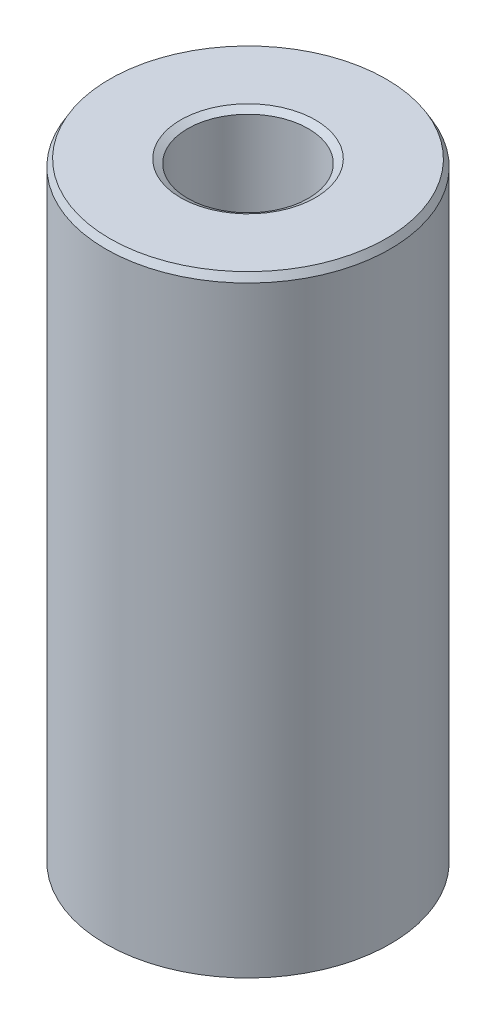
ISO-10303-21;
HEADER;
FILE_DESCRIPTION(('STEP AP214'),'2;1');
FILE_NAME('part.step','',(''),(''),'','','');
FILE_SCHEMA(('AUTOMOTIVE_DESIGN { 1 0 10303 214 1 1 1 1 }'));
ENDSEC;
DATA;
#1=APPLICATION_CONTEXT('core data for automotive mechanical design processes');
#2=APPLICATION_PROTOCOL_DEFINITION('international standard','automotive_design',2000,#1);
#3=PRODUCT_CONTEXT('',#1,'mechanical');
#4=PRODUCT('Part','Part','',(#3));
#5=PRODUCT_RELATED_PRODUCT_CATEGORY('part','',(#4));
#6=PRODUCT_DEFINITION_FORMATION('','',#4);
#7=PRODUCT_DEFINITION_CONTEXT('part definition',#1,'design');
#8=PRODUCT_DEFINITION('design','',#6,#7);
#9=PRODUCT_DEFINITION_SHAPE('','',#8);
#10=(LENGTH_UNIT() NAMED_UNIT(*) SI_UNIT(.MILLI.,.METRE.));
#11=(NAMED_UNIT(*) PLANE_ANGLE_UNIT() SI_UNIT($,.RADIAN.));
#12=(NAMED_UNIT(*) SI_UNIT($,.STERADIAN.) SOLID_ANGLE_UNIT());
#13=UNCERTAINTY_MEASURE_WITH_UNIT(LENGTH_MEASURE(1.E-05),#10,'distance_accuracy_value','');
#14=(GEOMETRIC_REPRESENTATION_CONTEXT(3) GLOBAL_UNCERTAINTY_ASSIGNED_CONTEXT((#13)) GLOBAL_UNIT_ASSIGNED_CONTEXT((#10,
#11,#12)) REPRESENTATION_CONTEXT('',''));
#15=CARTESIAN_POINT('',(0.,0.,0.));
#16=DIRECTION('',(0.,0.,1.));
#17=DIRECTION('',(1.,0.,0.));
#18=AXIS2_PLACEMENT_3D('',#15,#16,#17);
#19=CARTESIAN_POINT('',(0.,183.114524701273,0.));
#20=DIRECTION('',(0.,-1.,0.));
#21=DIRECTION('',(0.,0.,-1.));
#22=AXIS2_PLACEMENT_3D('',#19,#20,#21);
#23=CYLINDRICAL_SURFACE('',#22,42.5);
#24=CARTESIAN_POINT('',(0.,1.21213991563171,0.));
#25=DIRECTION('',(0.,1.,0.));
#26=DIRECTION('',(0.,0.,1.));
#27=AXIS2_PLACEMENT_3D('',#24,#25,#26);
#28=CIRCLE('',#27,42.5);
#29=CARTESIAN_POINT('',(0.,1.21213991563168,-42.5));
#30=VERTEX_POINT('',#29);
#31=EDGE_CURVE('E10',#30,#30,#28,.T.);
#32=CARTESIAN_POINT('',(0.,181.015036781517,0.));
#33=DIRECTION('',(0.,1.,0.));
#34=DIRECTION('',(0.,0.,1.));
#35=AXIS2_PLACEMENT_3D('',#32,#33,#34);
#36=CIRCLE('',#35,42.5);
#37=CARTESIAN_POINT('',(0.,181.015036781517,-42.5));
#38=VERTEX_POINT('',#37);
#39=EDGE_CURVE('E50',#38,#38,#36,.F.);
#40=CARTESIAN_POINT('',(0.,1.21213991563168,-42.5));
#41=CARTESIAN_POINT('',(0.,3.08508675798466,-42.5));
#42=CARTESIAN_POINT('',(0.,4.95803360033764,-42.5));
#43=CARTESIAN_POINT('',(0.,8.70392728504359,-42.5));
#44=CARTESIAN_POINT('',(0.,10.5768741273966,-42.5));
#45=CARTESIAN_POINT('',(0.,14.3227678121025,-42.5));
#46=CARTESIAN_POINT('',(0.,16.1957146544555,-42.5));
#47=CARTESIAN_POINT('',(0.,19.9416083391614,-42.5));
#48=CARTESIAN_POINT('',(0.,21.8145551815144,-42.5));
#49=CARTESIAN_POINT('',(0.,25.5604488662204,-42.5));
#50=CARTESIAN_POINT('',(0.,27.4333957085734,-42.5));
#51=CARTESIAN_POINT('',(0.,31.1792893932793,-42.5));
#52=CARTESIAN_POINT('',(0.,33.0522362356323,-42.5));
#53=CARTESIAN_POINT('',(0.,36.7981299203382,-42.5));
#54=CARTESIAN_POINT('',(0.,38.6710767626912,-42.5));
#55=CARTESIAN_POINT('',(0.,42.4169704473972,-42.5));
#56=CARTESIAN_POINT('',(0.,44.2899172897502,-42.5));
#57=CARTESIAN_POINT('',(0.,48.0358109744561,-42.5));
#58=CARTESIAN_POINT('',(0.,49.9087578168091,-42.5));
#59=CARTESIAN_POINT('',(0.,53.654651501515,-42.5));
#60=CARTESIAN_POINT('',(0.,55.527598343868,-42.5));
#61=CARTESIAN_POINT('',(0.,59.273492028574,-42.5));
#62=CARTESIAN_POINT('',(0.,61.1464388709269,-42.5));
#63=CARTESIAN_POINT('',(0.,64.8923325556329,-42.5));
#64=CARTESIAN_POINT('',(0.,66.7652793979858,-42.5));
#65=CARTESIAN_POINT('',(0.,70.5111730826918,-42.5));
#66=CARTESIAN_POINT('',(0.,72.3841199250448,-42.5));
#67=CARTESIAN_POINT('',(0.,76.1300136097507,-42.5));
#68=CARTESIAN_POINT('',(0.,78.0029604521037,-42.5));
#69=CARTESIAN_POINT('',(0.,81.7488541368097,-42.5));
#70=CARTESIAN_POINT('',(0.,83.6218009791626,-42.5));
#71=CARTESIAN_POINT('',(0.,87.3676946638686,-42.5));
#72=CARTESIAN_POINT('',(0.,89.2406415062216,-42.5));
#73=CARTESIAN_POINT('',(0.,92.9865351909275,-42.5));
#74=CARTESIAN_POINT('',(0.,94.8594820332805,-42.5));
#75=CARTESIAN_POINT('',(0.,98.6053757179864,-42.5));
#76=CARTESIAN_POINT('',(0.,100.478322560339,-42.5));
#77=CARTESIAN_POINT('',(0.,104.224216245045,-42.5));
#78=CARTESIAN_POINT('',(0.,106.097163087398,-42.5));
#79=CARTESIAN_POINT('',(0.,109.843056772104,-42.5));
#80=CARTESIAN_POINT('',(0.,111.716003614457,-42.5));
#81=CARTESIAN_POINT('',(0.,115.461897299163,-42.5));
#82=CARTESIAN_POINT('',(0.,117.334844141516,-42.5));
#83=CARTESIAN_POINT('',(0.,121.080737826222,-42.5));
#84=CARTESIAN_POINT('',(0.,122.953684668575,-42.5));
#85=CARTESIAN_POINT('',(0.,126.699578353281,-42.5));
#86=CARTESIAN_POINT('',(0.,128.572525195634,-42.5));
#87=CARTESIAN_POINT('',(0.,132.31841888034,-42.5));
#88=CARTESIAN_POINT('',(0.,134.191365722693,-42.5));
#89=CARTESIAN_POINT('',(0.,137.937259407399,-42.5));
#90=CARTESIAN_POINT('',(0.,139.810206249752,-42.5));
#91=CARTESIAN_POINT('',(0.,143.556099934458,-42.5));
#92=CARTESIAN_POINT('',(0.,145.429046776811,-42.5));
#93=CARTESIAN_POINT('',(0.,149.174940461517,-42.5));
#94=CARTESIAN_POINT('',(0.,151.04788730387,-42.5));
#95=CARTESIAN_POINT('',(0.,154.793780988576,-42.5));
#96=CARTESIAN_POINT('',(0.,156.666727830929,-42.5));
#97=CARTESIAN_POINT('',(0.,160.412621515635,-42.5));
#98=CARTESIAN_POINT('',(0.,162.285568357988,-42.5));
#99=CARTESIAN_POINT('',(0.,166.031462042694,-42.5));
#100=CARTESIAN_POINT('',(0.,167.904408885047,-42.5));
#101=CARTESIAN_POINT('',(0.,171.650302569753,-42.5));
#102=CARTESIAN_POINT('',(0.,173.523249412105,-42.5));
#103=CARTESIAN_POINT('',(0.,177.269143096811,-42.5));
#104=CARTESIAN_POINT('',(0.,179.142089939164,-42.5));
#105=CARTESIAN_POINT('',(0.,181.015036781517,-42.5));
#106=B_SPLINE_CURVE_WITH_KNOTS('',3,(#40,#41,#42,#43,#44,#45,#46,#47,#48,#49,#50,#51,#52,#53,
#54,#55,#56,#57,#58,#59,#60,#61,#62,#63,#64,#65,#66,#67,#68,#69,#70,#71,#72,#73,#74,#75,#76,#77,
#78,#79,#80,#81,#82,#83,#84,#85,#86,#87,#88,#89,#90,#91,#92,#93,#94,#95,#96,#97,#98,#99,#100,
#101,#102,#103,#104,#105),.UNSPECIFIED.,.F.,.F.,(4,2,2,2,2,2,2,2,2,2,2,2,2,2,2,2,2,2,2,2,2,2,2,
2,2,2,2,2,2,2,2,2,4),(0.,5.61884052705894,11.2376810541178,16.8565215811768,22.4753621082357,
28.0942026352947,33.7130431623536,39.3318836894125,44.9507242164714,50.5695647435304,
56.1884052705893,61.8072457976482,67.4260863247071,73.0449268517661,78.663767378825,
84.2826079058839,89.9014484329429,95.5202889600018,101.139129487061,106.75797001412,
112.376810541179,117.995651068238,123.614491595296,129.233332122355,134.852172649414,
140.471013176473,146.089853703532,151.708694230591,157.32753475765,162.946375284709,
168.565215811768,174.184056338827,179.802896865886),.UNSPECIFIED.);
#107=EDGE_CURVE('BSEAM39',#30,#38,#106,.T.);
#108=ORIENTED_EDGE('',*,*,#31,.T.);
#109=ORIENTED_EDGE('',*,*,#39,.T.);
#110=ORIENTED_EDGE('',*,*,#107,.T.);
#111=ORIENTED_EDGE('',*,*,#107,.F.);
#112=EDGE_LOOP('',(#108,#110,#109,#111));
#113=FACE_BOUND('',#112,.T.);
#114=ADVANCED_FACE('F39',(#113),#23,.T.);
#115=CARTESIAN_POINT('',(0.,183.114524701273,0.));
#116=DIRECTION('',(0.,1.,0.));
#117=DIRECTION('',(0.,0.,1.));
#118=AXIS2_PLACEMENT_3D('',#115,#116,#117);
#119=PLANE('',#118);
#120=CARTESIAN_POINT('',(0.,183.114524701273,0.));
#121=DIRECTION('',(0.,1.,0.));
#122=DIRECTION('',(0.,0.,1.));
#123=AXIS2_PLACEMENT_3D('',#120,#121,#122);
#124=CIRCLE('',#123,20.1404680415257);
#125=CARTESIAN_POINT('',(0.,183.114524701273,20.1404680415257));
#126=VERTEX_POINT('',#125);
#127=EDGE_CURVE('E58',#126,#126,#124,.F.);
#128=ORIENTED_EDGE('',*,*,#127,.T.);
#129=EDGE_LOOP('',(#128));
#130=FACE_BOUND('',#129,.T.);
#131=CARTESIAN_POINT('',(0.,183.114524701273,0.));
#132=DIRECTION('',(0.,1.,0.));
#133=DIRECTION('',(0.,0.,1.));
#134=AXIS2_PLACEMENT_3D('',#131,#132,#133);
#135=CIRCLE('',#134,41.2878600843685);
#136=CARTESIAN_POINT('',(0.,183.114524701273,41.2878600843685));
#137=VERTEX_POINT('',#136);
#138=EDGE_CURVE('E61',#137,#137,#135,.T.);
#139=ORIENTED_EDGE('',*,*,#138,.T.);
#140=EDGE_LOOP('',(#139));
#141=FACE_BOUND('',#140,.T.);
#142=ADVANCED_FACE('F88',(#130,#141),#119,.T.);
#143=CARTESIAN_POINT('',(0.,0.,0.));
#144=DIRECTION('',(0.,1.,0.));
#145=DIRECTION('',(0.,0.,1.));
#146=AXIS2_PLACEMENT_3D('',#143,#144,#145);
#147=PLANE('',#146);
#148=CARTESIAN_POINT('',(0.,0.,0.));
#149=DIRECTION('',(0.,1.,0.));
#150=DIRECTION('',(0.,0.,1.));
#151=AXIS2_PLACEMENT_3D('',#148,#149,#150);
#152=CIRCLE('',#151,19.2531200374009);
#153=CARTESIAN_POINT('',(0.,0.,19.2531200374009));
#154=VERTEX_POINT('',#153);
#155=EDGE_CURVE('E51',#154,#154,#152,.T.);
#156=ORIENTED_EDGE('',*,*,#155,.T.);
#157=EDGE_LOOP('',(#156));
#158=FACE_BOUND('',#157,.T.);
#159=CARTESIAN_POINT('',(0.,0.,0.));
#160=DIRECTION('',(0.,1.,0.));
#161=DIRECTION('',(0.,0.,1.));
#162=AXIS2_PLACEMENT_3D('',#159,#160,#161);
#163=CIRCLE('',#162,40.4005120802436);
#164=CARTESIAN_POINT('',(0.,0.,40.4005120802436));
#165=VERTEX_POINT('',#164);
#166=EDGE_CURVE('E54',#165,#165,#163,.F.);
#167=ORIENTED_EDGE('',*,*,#166,.T.);
#168=EDGE_LOOP('',(#167));
#169=FACE_BOUND('',#168,.T.);
#170=ADVANCED_FACE('F83',(#158,#169),#147,.F.);
#171=CARTESIAN_POINT('',(0.,183.114524701273,0.));
#172=DIRECTION('',(0.,-1.,0.));
#173=DIRECTION('',(0.,0.,-1.));
#174=AXIS2_PLACEMENT_3D('',#171,#172,#173);
#175=CYLINDRICAL_SURFACE('',#174,18.0409801217693);
#176=CARTESIAN_POINT('',(0.,181.902384785642,0.));
#177=DIRECTION('',(0.,1.,0.));
#178=DIRECTION('',(0.,0.,1.));
#179=AXIS2_PLACEMENT_3D('',#176,#177,#178);
#180=CIRCLE('',#179,18.0409801217693);
#181=CARTESIAN_POINT('',(0.,181.902384785642,-18.0409801217693));
#182=VERTEX_POINT('',#181);
#183=EDGE_CURVE('E67',#182,#182,#180,.T.);
#184=CARTESIAN_POINT('',(0.,2.09948791975623,0.));
#185=DIRECTION('',(0.,1.,0.));
#186=DIRECTION('',(0.,0.,1.));
#187=AXIS2_PLACEMENT_3D('',#184,#185,#186);
#188=CIRCLE('',#187,18.0409801217693);
#189=CARTESIAN_POINT('',(0.,2.09948791975623,-18.0409801217693));
#190=VERTEX_POINT('',#189);
#191=EDGE_CURVE('E69',#190,#190,#188,.F.);
#192=CARTESIAN_POINT('',(0.,181.902384785642,-18.0409801217693));
#193=CARTESIAN_POINT('',(0.,180.029437943289,-18.0409801217693));
#194=CARTESIAN_POINT('',(0.,178.156491100936,-18.0409801217693));
#195=CARTESIAN_POINT('',(0.,174.41059741623,-18.0409801217693));
#196=CARTESIAN_POINT('',(0.,172.537650573877,-18.0409801217693));
#197=CARTESIAN_POINT('',(0.,168.791756889171,-18.0409801217693));
#198=CARTESIAN_POINT('',(0.,166.918810046818,-18.0409801217693));
#199=CARTESIAN_POINT('',(0.,163.172916362112,-18.0409801217693));
#200=CARTESIAN_POINT('',(0.,161.299969519759,-18.0409801217693));
#201=CARTESIAN_POINT('',(0.,157.554075835053,-18.0409801217693));
#202=CARTESIAN_POINT('',(0.,155.6811289927,-18.0409801217693));
#203=CARTESIAN_POINT('',(0.,151.935235307994,-18.0409801217693));
#204=CARTESIAN_POINT('',(0.,150.062288465641,-18.0409801217693));
#205=CARTESIAN_POINT('',(0.,146.316394780935,-18.0409801217693));
#206=CARTESIAN_POINT('',(0.,144.443447938582,-18.0409801217693));
#207=CARTESIAN_POINT('',(0.,140.697554253876,-18.0409801217693));
#208=CARTESIAN_POINT('',(0.,138.824607411523,-18.0409801217693));
#209=CARTESIAN_POINT('',(0.,135.078713726817,-18.0409801217693));
#210=CARTESIAN_POINT('',(0.,133.205766884464,-18.0409801217693));
#211=CARTESIAN_POINT('',(0.,129.459873199758,-18.0409801217693));
#212=CARTESIAN_POINT('',(0.,127.586926357405,-18.0409801217693));
#213=CARTESIAN_POINT('',(0.,123.8410326727,-18.0409801217693));
#214=CARTESIAN_POINT('',(0.,121.968085830347,-18.0409801217693));
#215=CARTESIAN_POINT('',(0.,118.222192145641,-18.0409801217693));
#216=CARTESIAN_POINT('',(0.,116.349245303288,-18.0409801217693));
#217=CARTESIAN_POINT('',(0.,112.603351618582,-18.0409801217693));
#218=CARTESIAN_POINT('',(0.,110.730404776229,-18.0409801217693));
#219=CARTESIAN_POINT('',(0.,106.984511091523,-18.0409801217693));
#220=CARTESIAN_POINT('',(0.,105.11156424917,-18.0409801217693));
#221=CARTESIAN_POINT('',(0.,101.365670564464,-18.0409801217693));
#222=CARTESIAN_POINT('',(0.,99.4927237221109,-18.0409801217693));
#223=CARTESIAN_POINT('',(0.,95.7468300374049,-18.0409801217693));
#224=CARTESIAN_POINT('',(0.,93.8738831950519,-18.0409801217693));
#225=CARTESIAN_POINT('',(0.,90.127989510346,-18.0409801217693));
#226=CARTESIAN_POINT('',(0.,88.255042667993,-18.0409801217693));
#227=CARTESIAN_POINT('',(0.,84.5091489832871,-18.0409801217693));
#228=CARTESIAN_POINT('',(0.,82.6362021409341,-18.0409801217693));
#229=CARTESIAN_POINT('',(0.,78.8903084562281,-18.0409801217693));
#230=CARTESIAN_POINT('',(0.,77.0173616138752,-18.0409801217693));
#231=CARTESIAN_POINT('',(0.,73.2714679291692,-18.0409801217693));
#232=CARTESIAN_POINT('',(0.,71.3985210868163,-18.0409801217693));
#233=CARTESIAN_POINT('',(0.,67.6526274021103,-18.0409801217693));
#234=CARTESIAN_POINT('',(0.,65.7796805597573,-18.0409801217693));
#235=CARTESIAN_POINT('',(0.,62.0337868750514,-18.0409801217693));
#236=CARTESIAN_POINT('',(0.,60.1608400326984,-18.0409801217693));
#237=CARTESIAN_POINT('',(0.,56.4149463479925,-18.0409801217693));
#238=CARTESIAN_POINT('',(0.,54.5419995056395,-18.0409801217693));
#239=CARTESIAN_POINT('',(0.,50.7961058209335,-18.0409801217693));
#240=CARTESIAN_POINT('',(0.,48.9231589785806,-18.0409801217693));
#241=CARTESIAN_POINT('',(0.,45.1772652938746,-18.0409801217693));
#242=CARTESIAN_POINT('',(0.,43.3043184515217,-18.0409801217693));
#243=CARTESIAN_POINT('',(0.,39.5584247668157,-18.0409801217693));
#244=CARTESIAN_POINT('',(0.,37.6854779244627,-18.0409801217693));
#245=CARTESIAN_POINT('',(0.,33.9395842397568,-18.0409801217693));
#246=CARTESIAN_POINT('',(0.,32.0666373974038,-18.0409801217693));
#247=CARTESIAN_POINT('',(0.,28.3207437126979,-18.0409801217693));
#248=CARTESIAN_POINT('',(0.,26.4477968703449,-18.0409801217693));
#249=CARTESIAN_POINT('',(0.,22.7019031856389,-18.0409801217693));
#250=CARTESIAN_POINT('',(0.,20.828956343286,-18.0409801217693));
#251=CARTESIAN_POINT('',(0.,17.08306265858,-18.0409801217693));
#252=CARTESIAN_POINT('',(0.,15.210115816227,-18.0409801217693));
#253=CARTESIAN_POINT('',(0.,11.4642221315211,-18.0409801217693));
#254=CARTESIAN_POINT('',(0.,9.59127528916812,-18.0409801217693));
#255=CARTESIAN_POINT('',(0.,5.84538160446217,-18.0409801217693));
#256=CARTESIAN_POINT('',(0.,3.9724347621092,-18.0409801217693));
#257=CARTESIAN_POINT('',(0.,2.09948791975623,-18.0409801217693));
#258=B_SPLINE_CURVE_WITH_KNOTS('',3,(#192,#193,#194,#195,#196,#197,#198,#199,#200,#201,#202,
#203,#204,#205,#206,#207,#208,#209,#210,#211,#212,#213,#214,#215,#216,#217,#218,#219,#220,#221,
#222,#223,#224,#225,#226,#227,#228,#229,#230,#231,#232,#233,#234,#235,#236,#237,#238,#239,#240,
#241,#242,#243,#244,#245,#246,#247,#248,#249,#250,#251,#252,#253,#254,#255,#256,#257),
.UNSPECIFIED.,.F.,.F.,(4,2,2,2,2,2,2,2,2,2,2,2,2,2,2,2,2,2,2,2,2,2,2,2,2,2,2,2,2,2,2,2,4),(0.,
5.61884052705891,11.2376810541178,16.8565215811768,22.4753621082357,28.0942026352946,
33.7130431623535,39.3318836894124,44.9507242164713,50.5695647435303,56.1884052705892,
61.8072457976481,67.426086324707,73.044926851766,78.6637673788249,84.2826079058838,
89.9014484329427,95.5202889600016,101.139129487061,106.757970014119,112.376810541178,
117.995651068237,123.614491595296,129.233332122355,134.852172649414,140.471013176473,
146.089853703532,151.708694230591,157.32753475765,162.946375284709,168.565215811768,
174.184056338827,179.802896865885),.UNSPECIFIED.);
#259=EDGE_CURVE('BSEAM71',#182,#190,#258,.T.);
#260=ORIENTED_EDGE('',*,*,#183,.T.);
#261=ORIENTED_EDGE('',*,*,#191,.T.);
#262=ORIENTED_EDGE('',*,*,#259,.T.);
#263=ORIENTED_EDGE('',*,*,#259,.F.);
#264=EDGE_LOOP('',(#260,#262,#261,#263));
#265=FACE_BOUND('',#264,.T.);
#266=ADVANCED_FACE('F71',(#265),#175,.F.);
#267=CARTESIAN_POINT('',(0.,181.902384785642,0.));
#268=DIRECTION('',(0.,1.,0.));
#269=DIRECTION('',(0.,0.,1.));
#270=AXIS2_PLACEMENT_3D('',#267,#268,#269);
#271=CONICAL_SURFACE('',#270,18.0409801217693,1.04719755119659);
#272=ORIENTED_EDGE('',*,*,#127,.F.);
#273=EDGE_LOOP('',(#272));
#274=FACE_BOUND('',#273,.T.);
#275=ORIENTED_EDGE('',*,*,#183,.F.);
#276=EDGE_LOOP('',(#275));
#277=FACE_BOUND('',#276,.T.);
#278=ADVANCED_FACE('F77',(#274,#277),#271,.F.);
#279=CARTESIAN_POINT('',(0.,0.,0.));
#280=DIRECTION('',(0.,-1.,0.));
#281=DIRECTION('',(0.,0.,-1.));
#282=AXIS2_PLACEMENT_3D('',#279,#280,#281);
#283=CONICAL_SURFACE('',#282,19.2531200374009,0.523598775598293);
#284=ORIENTED_EDGE('',*,*,#191,.F.);
#285=EDGE_LOOP('',(#284));
#286=FACE_BOUND('',#285,.T.);
#287=ORIENTED_EDGE('',*,*,#155,.F.);
#288=EDGE_LOOP('',(#287));
#289=FACE_BOUND('',#288,.T.);
#290=ADVANCED_FACE('F73',(#286,#289),#283,.F.);
#291=CARTESIAN_POINT('',(0.,1.21213991563171,0.));
#292=DIRECTION('',(0.,1.,0.));
#293=DIRECTION('',(0.,0.,1.));
#294=AXIS2_PLACEMENT_3D('',#291,#292,#293);
#295=CONICAL_SURFACE('',#294,42.5,1.0471975511966);
#296=ORIENTED_EDGE('',*,*,#166,.F.);
#297=EDGE_LOOP('',(#296));
#298=FACE_BOUND('',#297,.T.);
#299=ORIENTED_EDGE('',*,*,#31,.F.);
#300=EDGE_LOOP('',(#299));
#301=FACE_BOUND('',#300,.T.);
#302=ADVANCED_FACE('F76',(#298,#301),#295,.T.);
#303=CARTESIAN_POINT('',(0.,183.114524701273,0.));
#304=DIRECTION('',(0.,-1.,0.));
#305=DIRECTION('',(0.,0.,-1.));
#306=AXIS2_PLACEMENT_3D('',#303,#304,#305);
#307=CONICAL_SURFACE('',#306,41.2878600843685,0.523598775598288);
#308=ORIENTED_EDGE('',*,*,#39,.F.);
#309=EDGE_LOOP('',(#308));
#310=FACE_BOUND('',#309,.T.);
#311=ORIENTED_EDGE('',*,*,#138,.F.);
#312=EDGE_LOOP('',(#311));
#313=FACE_BOUND('',#312,.T.);
#314=ADVANCED_FACE('F45',(#310,#313),#307,.T.);
#315=CLOSED_SHELL('',(#114,#142,#170,#266,#278,#290,#302,#314));
#316=MANIFOLD_SOLID_BREP('B2',#315);
#317=ADVANCED_BREP_SHAPE_REPRESENTATION('',(#18,#316),#14);
#318=SHAPE_DEFINITION_REPRESENTATION(#9,#317);
ENDSEC;
END-ISO-10303-21;
